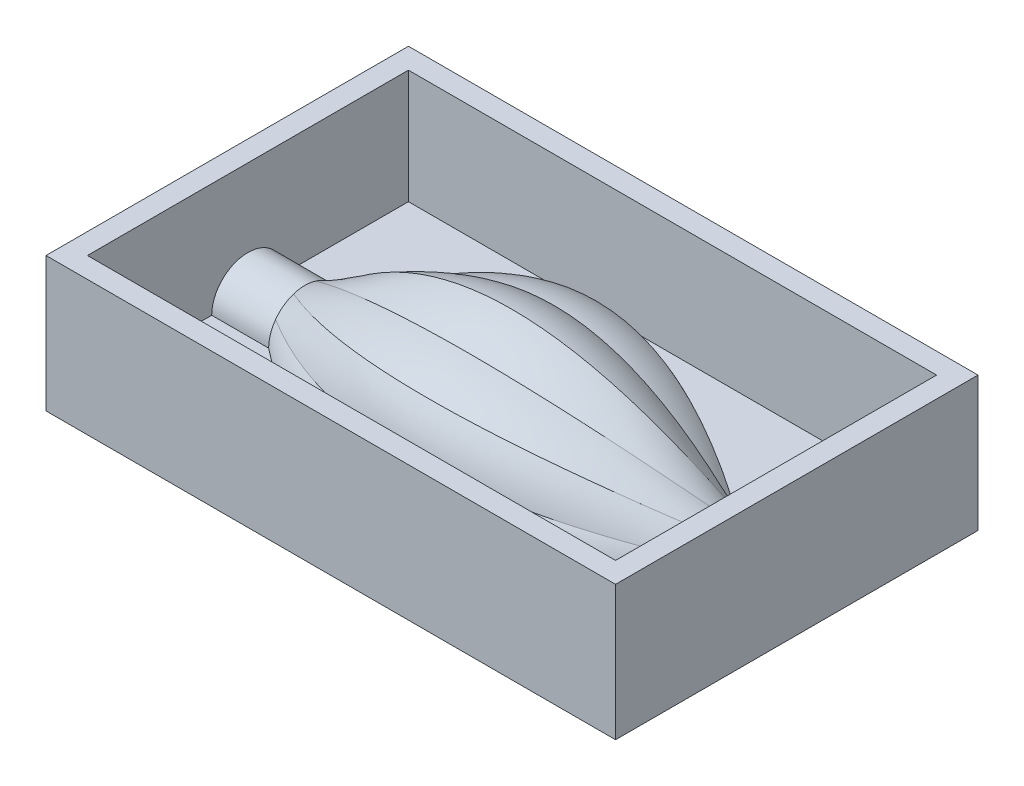
ISO-10303-21;
HEADER;
FILE_DESCRIPTION(('STEP AP214'),'2;1');
FILE_NAME('part.step','',(''),(''),'','','');
FILE_SCHEMA(('AUTOMOTIVE_DESIGN { 1 0 10303 214 1 1 1 1 }'));
ENDSEC;
DATA;
#1=APPLICATION_CONTEXT('core data for automotive mechanical design processes');
#2=APPLICATION_PROTOCOL_DEFINITION('international standard','automotive_design',2000,#1);
#3=PRODUCT_CONTEXT('',#1,'mechanical');
#4=PRODUCT('Part','Part','',(#3));
#5=PRODUCT_RELATED_PRODUCT_CATEGORY('part','',(#4));
#6=PRODUCT_DEFINITION_FORMATION('','',#4);
#7=PRODUCT_DEFINITION_CONTEXT('part definition',#1,'design');
#8=PRODUCT_DEFINITION('design','',#6,#7);
#9=PRODUCT_DEFINITION_SHAPE('','',#8);
#10=(LENGTH_UNIT() NAMED_UNIT(*) SI_UNIT(.MILLI.,.METRE.));
#11=(NAMED_UNIT(*) PLANE_ANGLE_UNIT() SI_UNIT($,.RADIAN.));
#12=(NAMED_UNIT(*) SI_UNIT($,.STERADIAN.) SOLID_ANGLE_UNIT());
#13=UNCERTAINTY_MEASURE_WITH_UNIT(LENGTH_MEASURE(1.E-05),#10,'distance_accuracy_value','');
#14=(GEOMETRIC_REPRESENTATION_CONTEXT(3) GLOBAL_UNCERTAINTY_ASSIGNED_CONTEXT((#13)) GLOBAL_UNIT_ASSIGNED_CONTEXT((#10,
#11,#12)) REPRESENTATION_CONTEXT('',''));
#15=CARTESIAN_POINT('',(0.,0.,0.));
#16=DIRECTION('',(0.,0.,1.));
#17=DIRECTION('',(1.,0.,0.));
#18=AXIS2_PLACEMENT_3D('',#15,#16,#17);
#19=CARTESIAN_POINT('',(-40.,0.,-7.));
#20=CARTESIAN_POINT('',(-26.6666666666667,13.0598267919562,-7.74289071280507));
#21=CARTESIAN_POINT('',(0.,26.1196535839123,-8.48578142561015));
#22=CARTESIAN_POINT('',(26.6666666666667,13.0598267919562,-7.74289071280507));
#23=CARTESIAN_POINT('',(40.,0.,-7.));
#24=CARTESIAN_POINT('',(-40.,1.47822579558818,-7.));
#25=CARTESIAN_POINT('',(-26.6666666666667,14.3815554866597,-6.23678959506464));
#26=CARTESIAN_POINT('',(0.,28.4089485090481,-5.24723210024778));
#27=CARTESIAN_POINT('',(26.6666666666667,14.3815554866597,-6.23678959506464));
#28=CARTESIAN_POINT('',(40.,1.47822579558818,-7.));
#29=CARTESIAN_POINT('',(-40.,2.91858697589288,-6.53199828282975));
#30=CARTESIAN_POINT('',(-26.6666666666667,15.6654195660797,-4.26268676015395));
#31=CARTESIAN_POINT('',(0.,29.472014573582,-1.63707421355165));
#32=CARTESIAN_POINT('',(26.6666666666667,15.6654195660797,-4.26268676015395));
#33=CARTESIAN_POINT('',(40.,2.91858697589288,-6.53199828282975));
#34=CARTESIAN_POINT('',(-40.,4.11449676604717,-5.66311896062474));
#35=CARTESIAN_POINT('',(-26.6666666666667,16.7048322553493,-1.88770632020851));
#36=CARTESIAN_POINT('',(0.,29.2951677446515,1.88770632020772));
#37=CARTESIAN_POINT('',(26.6666666666667,16.7048322553493,-1.88770632020851));
#38=CARTESIAN_POINT('',(40.,4.11449676604717,-5.66311896062474));
#39=B_SPLINE_SURFACE_WITH_KNOTS('',3,3,((#19,#20,#21,#22,#23),(#24,#25,#26,#27,#28),(#29,#30,
#31,#32,#33),(#34,#35,#36,#37,#38)),.UNSPECIFIED.,.F.,.F.,.F.,(4,4),(4,1,4),(0.,1.),(0.,0.5,1.),.UNSPECIFIED.);
#40=CARTESIAN_POINT('',(-40.,0.,0.));
#41=DIRECTION('',(1.,0.,0.));
#42=DIRECTION('',(0.,0.,-1.));
#43=AXIS2_PLACEMENT_3D('',#40,#41,#42);
#44=CIRCLE('',#43,7.);
#45=CARTESIAN_POINT('',(-40.,0.,-7.));
#46=VERTEX_POINT('',#45);
#47=CARTESIAN_POINT('',(-40.,4.11449676604717,-5.66311896062474));
#48=VERTEX_POINT('',#47);
#49=EDGE_CURVE('E334',#46,#48,#44,.T.);
#50=CARTESIAN_POINT('',(-40.,4.11449676604717,-5.66311896062474));
#51=CARTESIAN_POINT('',(-26.6666666666667,16.7048322553493,-1.88770632020851));
#52=CARTESIAN_POINT('',(0.,29.2951677446515,1.88770632020772));
#53=CARTESIAN_POINT('',(26.6666666666667,16.7048322553493,-1.88770632020851));
#54=CARTESIAN_POINT('',(40.,4.11449676604717,-5.66311896062474));
#55=B_SPLINE_CURVE_WITH_KNOTS('',3,(#50,#51,#52,#53,#54),.UNSPECIFIED.,.F.,.F.,(4,1,4),(0.,0.5,
1.),.UNSPECIFIED.);
#56=CARTESIAN_POINT('',(40.,4.11449676604717,-5.66311896062474));
#57=VERTEX_POINT('',#56);
#58=EDGE_CURVE('E379',#48,#57,#55,.T.);
#59=CARTESIAN_POINT('',(40.,0.,0.));
#60=DIRECTION('',(1.,0.,0.));
#61=DIRECTION('',(0.,0.,-1.));
#62=AXIS2_PLACEMENT_3D('',#59,#60,#61);
#63=CIRCLE('',#62,7.);
#64=CARTESIAN_POINT('',(40.,0.,-7.));
#65=VERTEX_POINT('',#64);
#66=EDGE_CURVE('E241',#65,#57,#63,.T.);
#67=CARTESIAN_POINT('',(-40.,0.,-7.));
#68=CARTESIAN_POINT('',(-26.6666666666667,13.0598267919562,-7.74289071280507));
#69=CARTESIAN_POINT('',(0.,26.1196535839123,-8.48578142561015));
#70=CARTESIAN_POINT('',(26.6666666666667,13.0598267919562,-7.74289071280507));
#71=CARTESIAN_POINT('',(40.,0.,-7.));
#72=B_SPLINE_CURVE_WITH_KNOTS('',3,(#67,#68,#69,#70,#71),.UNSPECIFIED.,.F.,.F.,(4,1,4),(0.,0.5,
1.),.UNSPECIFIED.);
#73=EDGE_CURVE('E374',#65,#46,#72,.F.);
#74=ORIENTED_EDGE('',*,*,#49,.T.);
#75=ORIENTED_EDGE('',*,*,#58,.T.);
#76=ORIENTED_EDGE('',*,*,#66,.F.);
#77=ORIENTED_EDGE('',*,*,#73,.T.);
#78=EDGE_LOOP('',(#74,#75,#76,#77));
#79=FACE_BOUND('',#78,.T.);
#80=ADVANCED_FACE('F127',(#79),#39,.T.);
#81=CARTESIAN_POINT('',(-40.,4.11449676604717,-5.66311896062474));
#82=CARTESIAN_POINT('',(-26.6666666666667,16.7048322553493,-1.8877063202085));
#83=CARTESIAN_POINT('',(0.,29.2951677446514,1.88770632020775));
#84=CARTESIAN_POINT('',(26.6666666666667,16.7048322553493,-1.8877063202085));
#85=CARTESIAN_POINT('',(40.,4.11449676604717,-5.66311896062474));
#86=CARTESIAN_POINT('',(-40.,5.31040655620154,-4.79423963841967));
#87=CARTESIAN_POINT('',(-26.6666666666667,16.577817898818,0.00658101737605748));
#88=CARTESIAN_POINT('',(0.,28.5596162408436,5.89317995632842));
#89=CARTESIAN_POINT('',(26.6666666666667,16.577817898818,0.00658101737605749));
#90=CARTESIAN_POINT('',(40.,5.31040655620154,-4.79423963841967));
#91=CARTESIAN_POINT('',(-40.,6.20059872170584,-3.56899523607451));
#92=CARTESIAN_POINT('',(-26.6666666666667,16.1450859176367,2.2572334351007));
#93=CARTESIAN_POINT('',(0.,26.6454180780708,9.22678826021097));
#94=CARTESIAN_POINT('',(26.6666666666667,16.1450859176367,2.2572334351007));
#95=CARTESIAN_POINT('',(40.,6.20059872170584,-3.56899523607451));
#96=CARTESIAN_POINT('',(-40.,6.65739561406606,-2.16311896062469));
#97=CARTESIAN_POINT('',(-26.6666666666667,15.2789586633113,4.68851772593));
#98=CARTESIAN_POINT('',(0.,23.9005217125565,11.5401544124847));
#99=CARTESIAN_POINT('',(26.6666666666667,15.2789586633113,4.68851772593));
#100=CARTESIAN_POINT('',(40.,6.65739561406606,-2.16311896062469));
#101=B_SPLINE_SURFACE_WITH_KNOTS('',3,3,((#81,#82,#83,#84,#85),(#86,#87,#88,#89,#90),(#91,#92,
#93,#94,#95),(#96,#97,#98,#99,#100)),.UNSPECIFIED.,.F.,.F.,.F.,(4,4),(4,1,4),(0.,1.),(0.,0.5,
1.),.UNSPECIFIED.);
#102=CARTESIAN_POINT('',(-40.,6.65739561406606,-2.16311896062469));
#103=VERTEX_POINT('',#102);
#104=EDGE_CURVE('E332',#48,#103,#44,.T.);
#105=CARTESIAN_POINT('',(-40.,6.65739561406606,-2.16311896062469));
#106=CARTESIAN_POINT('',(-26.6666666666667,15.2789586633113,4.68851772593));
#107=CARTESIAN_POINT('',(0.,23.9005217125565,11.5401544124847));
#108=CARTESIAN_POINT('',(26.6666666666667,15.2789586633113,4.68851772593));
#109=CARTESIAN_POINT('',(40.,6.65739561406606,-2.16311896062469));
#110=B_SPLINE_CURVE_WITH_KNOTS('',3,(#105,#106,#107,#108,#109),.UNSPECIFIED.,.F.,.F.,(4,1,4),
(0.,0.5,1.),.UNSPECIFIED.);
#111=CARTESIAN_POINT('',(40.,6.65739561406606,-2.16311896062469));
#112=VERTEX_POINT('',#111);
#113=EDGE_CURVE('E192',#103,#112,#110,.T.);
#114=EDGE_CURVE('E198',#57,#112,#63,.T.);
#115=ORIENTED_EDGE('',*,*,#104,.T.);
#116=ORIENTED_EDGE('',*,*,#113,.T.);
#117=ORIENTED_EDGE('',*,*,#114,.F.);
#118=ORIENTED_EDGE('',*,*,#58,.F.);
#119=EDGE_LOOP('',(#115,#116,#117,#118));
#120=FACE_BOUND('',#119,.T.);
#121=ADVANCED_FACE('F585',(#120),#101,.T.);
#122=CARTESIAN_POINT('',(-40.,0.,-5.29811695465203));
#123=CARTESIAN_POINT('',(-26.6666666666667,10.8423039781939,-12.6083429630781));
#124=CARTESIAN_POINT('',(0.,21.6846079563879,-19.9185689715042));
#125=CARTESIAN_POINT('',(26.6666666666667,10.8423039781939,-12.6083429630781));
#126=CARTESIAN_POINT('',(40.,0.,-5.29811695465203));
#127=CARTESIAN_POINT('',(-40.,0.,-5.86541130310135));
#128=CARTESIAN_POINT('',(-26.6666666666667,11.581478249448,-10.9865255463204));
#129=CARTESIAN_POINT('',(0.,24.5072685079548,-16.7586992273094));
#130=CARTESIAN_POINT('',(26.6666666666667,11.581478249448,-10.9865255463204));
#131=CARTESIAN_POINT('',(40.,0.,-5.86541130310135));
#132=CARTESIAN_POINT('',(-40.,0.,-6.43270565155068));
#133=CARTESIAN_POINT('',(-26.6666666666667,12.320652520702,-9.36470812956275));
#134=CARTESIAN_POINT('',(0.,26.0572326411018,-12.7723178001438));
#135=CARTESIAN_POINT('',(26.6666666666667,12.320652520702,-9.36470812956275));
#136=CARTESIAN_POINT('',(40.,0.,-6.43270565155068));
#137=CARTESIAN_POINT('',(-40.,0.,-7.));
#138=CARTESIAN_POINT('',(-26.6666666666667,13.0598267919561,-7.74289071280506));
#139=CARTESIAN_POINT('',(0.,26.1196535839122,-8.48578142561012));
#140=CARTESIAN_POINT('',(26.6666666666667,13.0598267919561,-7.74289071280506));
#141=CARTESIAN_POINT('',(40.,0.,-7.));
#142=B_SPLINE_SURFACE_WITH_KNOTS('',3,3,((#122,#123,#124,#125,#126),(#127,#128,#129,#130,#131),
(#132,#133,#134,#135,#136),(#137,#138,#139,#140,#141)),.UNSPECIFIED.,.F.,.F.,.F.,(4,4),(4,1,4),
(0.,1.),(0.,0.5,1.),.UNSPECIFIED.);
#143=DIRECTION('',(0.,0.,-1.));
#144=VECTOR('',#143,1.);
#145=CARTESIAN_POINT('',(-40.,0.,7.));
#146=LINE('',#145,#144);
#147=CARTESIAN_POINT('',(-40.,0.,-5.29811695465203));
#148=VERTEX_POINT('',#147);
#149=EDGE_CURVE('E337',#148,#46,#146,.T.);
#150=DIRECTION('',(0.,0.,-1.));
#151=VECTOR('',#150,1.);
#152=CARTESIAN_POINT('',(40.,0.,7.));
#153=LINE('',#152,#151);
#154=CARTESIAN_POINT('',(40.,0.,-5.29811695465203));
#155=VERTEX_POINT('',#154);
#156=EDGE_CURVE('E254',#155,#65,#153,.T.);
#157=CARTESIAN_POINT('',(-40.,0.,-5.29811695465203));
#158=CARTESIAN_POINT('',(-26.6666666666667,10.8423039781939,-12.6083429630782));
#159=CARTESIAN_POINT('',(0.,21.6846079563879,-19.9185689715043));
#160=CARTESIAN_POINT('',(26.6666666666667,10.8423039781939,-12.6083429630782));
#161=CARTESIAN_POINT('',(40.,0.,-5.29811695465203));
#162=B_SPLINE_CURVE_WITH_KNOTS('',3,(#157,#158,#159,#160,#161),.UNSPECIFIED.,.F.,.F.,(4,1,4),
(0.,0.5,1.),.UNSPECIFIED.);
#163=EDGE_CURVE('E347',#148,#155,#162,.T.);
#164=ORIENTED_EDGE('',*,*,#149,.T.);
#165=ORIENTED_EDGE('',*,*,#73,.F.);
#166=ORIENTED_EDGE('',*,*,#156,.F.);
#167=ORIENTED_EDGE('',*,*,#163,.F.);
#168=EDGE_LOOP('',(#164,#165,#166,#167));
#169=FACE_BOUND('',#168,.T.);
#170=ADVANCED_FACE('F376',(#169),#142,.T.);
#171=CARTESIAN_POINT('',(-40.,6.65739561406606,-2.16311896062469));
#172=CARTESIAN_POINT('',(-26.6666666666667,15.2789586633113,4.68851772592999));
#173=CARTESIAN_POINT('',(0.,23.9005217125565,11.5401544124847));
#174=CARTESIAN_POINT('',(26.6666666666667,15.2789586633113,4.68851772592999));
#175=CARTESIAN_POINT('',(40.,6.65739561406606,-2.16311896062469));
#176=CARTESIAN_POINT('',(-40.,7.11419250642625,-0.757242685174951));
#177=CARTESIAN_POINT('',(-26.6666666666667,14.9965812844174,6.94392332956505));
#178=CARTESIAN_POINT('',(0.,23.3813038773858,15.1931026001406));
#179=CARTESIAN_POINT('',(26.6666666666667,14.9965812844174,6.94392332956505));
#180=CARTESIAN_POINT('',(40.,7.11419250642625,-0.757242685174951));
#181=CARTESIAN_POINT('',(-40.,7.11419250642628,0.757242685174696));
#182=CARTESIAN_POINT('',(-26.6666666666667,14.2574070131634,9.30793802810001));
#183=CARTESIAN_POINT('',(0.,21.8313397442389,18.4372867455285));
#184=CARTESIAN_POINT('',(26.6666666666667,14.2574070131634,9.30793802810001));
#185=CARTESIAN_POINT('',(40.,7.11419250642628,0.757242685174696));
#186=CARTESIAN_POINT('',(-40.,6.65739561406613,2.16311896062445));
#187=CARTESIAN_POINT('',(-26.6666666666667,13.0614358495492,11.5633436317351));
#188=CARTESIAN_POINT('',(0.,19.4654760850323,20.9635683028457));
#189=CARTESIAN_POINT('',(26.6666666666667,13.0614358495492,11.5633436317351));
#190=CARTESIAN_POINT('',(40.,6.65739561406613,2.16311896062445));
#191=B_SPLINE_SURFACE_WITH_KNOTS('',3,3,((#171,#172,#173,#174,#175),(#176,#177,#178,#179,#180),
(#181,#182,#183,#184,#185),(#186,#187,#188,#189,#190)),.UNSPECIFIED.,.F.,.F.,.F.,(4,4),(4,1,4),
(0.,1.),(0.,0.5,1.),.UNSPECIFIED.);
#192=CARTESIAN_POINT('',(-40.,6.65739561406613,2.16311896062445));
#193=VERTEX_POINT('',#192);
#194=EDGE_CURVE('E149',#103,#193,#44,.T.);
#195=CARTESIAN_POINT('',(-40.,6.65739561406613,2.16311896062445));
#196=CARTESIAN_POINT('',(-26.6666666666667,13.0614358495492,11.5633436317351));
#197=CARTESIAN_POINT('',(0.,19.4654760850323,20.9635683028457));
#198=CARTESIAN_POINT('',(26.6666666666667,13.0614358495492,11.5633436317351));
#199=CARTESIAN_POINT('',(40.,6.65739561406613,2.16311896062445));
#200=B_SPLINE_CURVE_WITH_KNOTS('',3,(#195,#196,#197,#198,#199),.UNSPECIFIED.,.F.,.F.,(4,1,4),
(0.,0.5,1.),.UNSPECIFIED.);
#201=CARTESIAN_POINT('',(40.,6.65739561406613,2.16311896062445));
#202=VERTEX_POINT('',#201);
#203=EDGE_CURVE('E174',#193,#202,#200,.T.);
#204=EDGE_CURVE('E181',#112,#202,#63,.T.);
#205=ORIENTED_EDGE('',*,*,#194,.T.);
#206=ORIENTED_EDGE('',*,*,#203,.T.);
#207=ORIENTED_EDGE('',*,*,#204,.F.);
#208=ORIENTED_EDGE('',*,*,#113,.F.);
#209=EDGE_LOOP('',(#205,#206,#207,#208));
#210=FACE_BOUND('',#209,.T.);
#211=ADVANCED_FACE('F187',(#210),#191,.T.);
#212=CARTESIAN_POINT('',(-40.,6.65739561406613,2.16311896062445));
#213=CARTESIAN_POINT('',(-26.6666666666667,13.0614358495492,11.5633436317351));
#214=CARTESIAN_POINT('',(0.,19.4654760850324,20.9635683028457));
#215=CARTESIAN_POINT('',(26.6666666666667,13.0614358495492,11.5633436317351));
#216=CARTESIAN_POINT('',(40.,6.65739561406613,2.16311896062445));
#217=CARTESIAN_POINT('',(-40.,6.20059872170594,3.56899523607437));
#218=CARTESIAN_POINT('',(-26.6666666666667,11.3588120571746,12.9306164006612));
#219=CARTESIAN_POINT('',(0.,16.3864127164543,23.1581303567408));
#220=CARTESIAN_POINT('',(26.6666666666667,11.3588120571746,12.9306164006612));
#221=CARTESIAN_POINT('',(40.,6.20059872170594,3.56899523607437));
#222=CARTESIAN_POINT('',(-40.,5.31040655620161,4.79423963841961));
#223=CARTESIAN_POINT('',(-26.6666666666667,9.22279299165583,14.1172572964827));
#224=CARTESIAN_POINT('',(0.,12.9142329380495,24.2606278653204));
#225=CARTESIAN_POINT('',(26.6666666666667,9.22279299165583,14.1172572964827));
#226=CARTESIAN_POINT('',(40.,5.31040655620161,4.79423963841961));
#227=CARTESIAN_POINT('',(-40.,4.11449676604717,5.66311896062473));
#228=CARTESIAN_POINT('',(-26.6666666666667,6.78105630148695,14.9475331121641));
#229=CARTESIAN_POINT('',(0.,9.44761583692672,24.2319472637035));
#230=CARTESIAN_POINT('',(26.6666666666667,6.78105630148695,14.9475331121641));
#231=CARTESIAN_POINT('',(40.,4.11449676604717,5.66311896062473));
#232=B_SPLINE_SURFACE_WITH_KNOTS('',3,3,((#212,#213,#214,#215,#216),(#217,#218,#219,#220,#221),
(#222,#223,#224,#225,#226),(#227,#228,#229,#230,#231)),.UNSPECIFIED.,.F.,.F.,.F.,(4,4),(4,1,4),
(0.,1.),(0.,0.5,1.),.UNSPECIFIED.);
#233=CARTESIAN_POINT('',(-40.,4.11449676604717,5.66311896062473));
#234=VERTEX_POINT('',#233);
#235=EDGE_CURVE('E313',#193,#234,#44,.T.);
#236=CARTESIAN_POINT('',(-40.,4.11449676604717,5.66311896062473));
#237=CARTESIAN_POINT('',(-26.6666666666667,6.78105630148695,14.9475331121641));
#238=CARTESIAN_POINT('',(0.,9.44761583692672,24.2319472637035));
#239=CARTESIAN_POINT('',(26.6666666666667,6.78105630148695,14.9475331121641));
#240=CARTESIAN_POINT('',(40.,4.11449676604717,5.66311896062473));
#241=B_SPLINE_CURVE_WITH_KNOTS('',3,(#236,#237,#238,#239,#240),.UNSPECIFIED.,.F.,.F.,(4,1,4),
(0.,0.5,1.),.UNSPECIFIED.);
#242=CARTESIAN_POINT('',(40.,4.11449676604717,5.66311896062473));
#243=VERTEX_POINT('',#242);
#244=EDGE_CURVE('E176',#234,#243,#241,.T.);
#245=EDGE_CURVE('E168',#202,#243,#63,.T.);
#246=ORIENTED_EDGE('',*,*,#235,.T.);
#247=ORIENTED_EDGE('',*,*,#244,.T.);
#248=ORIENTED_EDGE('',*,*,#245,.F.);
#249=ORIENTED_EDGE('',*,*,#203,.F.);
#250=EDGE_LOOP('',(#246,#247,#248,#249));
#251=FACE_BOUND('',#250,.T.);
#252=ADVANCED_FACE('F172',(#251),#232,.T.);
#253=CARTESIAN_POINT('',(-40.,4.11449676604717,5.66311896062473));
#254=CARTESIAN_POINT('',(-26.6666666666667,6.78105630148695,14.9475331121641));
#255=CARTESIAN_POINT('',(0.,9.44761583692673,24.2319472637035));
#256=CARTESIAN_POINT('',(26.6666666666667,6.78105630148695,14.9475331121641));
#257=CARTESIAN_POINT('',(40.,4.11449676604717,5.66311896062473));
#258=CARTESIAN_POINT('',(-40.,2.91858697589289,6.53199828282975));
#259=CARTESIAN_POINT('',(-26.6666666666667,4.69629333285265,16.2771632727449));
#260=CARTESIAN_POINT('',(0.,6.78772836245819,26.513340722962));
#261=CARTESIAN_POINT('',(26.6666666666667,4.69629333285265,16.2771632727449));
#262=CARTESIAN_POINT('',(40.,2.91858697589289,6.53199828282975));
#263=CARTESIAN_POINT('',(-40.,1.47822579558818,7.));
#264=CARTESIAN_POINT('',(-26.6666666666667,2.36707897406793,17.2059158282908));
#265=CARTESIAN_POINT('',(0.,3.53268199963608,27.9315183113699));
#266=CARTESIAN_POINT('',(26.6666666666667,2.36707897406793,17.2059158282908));
#267=CARTESIAN_POINT('',(40.,1.47822579558818,7.));
#268=CARTESIAN_POINT('',(-40.,0.,7.));
#269=CARTESIAN_POINT('',(-26.6666666666667,-2.68044845578667E-13,17.6666666666666));
#270=CARTESIAN_POINT('',(0.,-5.36866847274572E-13,28.3333333333331));
#271=CARTESIAN_POINT('',(26.6666666666667,-2.68044845578667E-13,17.6666666666666));
#272=CARTESIAN_POINT('',(40.,0.,7.));
#273=B_SPLINE_SURFACE_WITH_KNOTS('',3,3,((#253,#254,#255,#256,#257),(#258,#259,#260,#261,#262),
(#263,#264,#265,#266,#267),(#268,#269,#270,#271,#272)),.UNSPECIFIED.,.F.,.F.,.F.,(4,4),(4,1,4),
(0.,1.),(0.,0.5,1.),.UNSPECIFIED.);
#274=CARTESIAN_POINT('',(-40.,0.,7.));
#275=VERTEX_POINT('',#274);
#276=EDGE_CURVE('E134',#234,#275,#44,.T.);
#277=CARTESIAN_POINT('',(-40.,0.,7.));
#278=CARTESIAN_POINT('',(-26.6666666666667,-2.68044845578667E-13,17.6666666666666));
#279=CARTESIAN_POINT('',(0.,-5.36866847274572E-13,28.3333333333331));
#280=CARTESIAN_POINT('',(26.6666666666667,-2.68044845578667E-13,17.6666666666666));
#281=CARTESIAN_POINT('',(40.,0.,7.));
#282=B_SPLINE_CURVE_WITH_KNOTS('',3,(#277,#278,#279,#280,#281),.UNSPECIFIED.,.F.,.F.,(4,1,4),
(0.,0.5,1.),.UNSPECIFIED.);
#283=CARTESIAN_POINT('',(40.,0.,7.));
#284=VERTEX_POINT('',#283);
#285=EDGE_CURVE('E324',#275,#284,#282,.T.);
#286=EDGE_CURVE('E182',#243,#284,#63,.T.);
#287=ORIENTED_EDGE('',*,*,#276,.T.);
#288=ORIENTED_EDGE('',*,*,#285,.T.);
#289=ORIENTED_EDGE('',*,*,#286,.F.);
#290=ORIENTED_EDGE('',*,*,#244,.F.);
#291=EDGE_LOOP('',(#287,#288,#289,#290));
#292=FACE_BOUND('',#291,.T.);
#293=ADVANCED_FACE('F622',(#292),#273,.T.);
#294=CARTESIAN_POINT('',(-40.,0.,-1.89435086395607));
#295=CARTESIAN_POINT('',(-26.6666666666667,-2.72640706307688E-13,-15.9647836213195));
#296=CARTESIAN_POINT('',(0.,-5.45281412615377E-13,-30.0352163786829));
#297=CARTESIAN_POINT('',(26.6666666666667,-2.72640706307688E-13,-15.9647836213195));
#298=CARTESIAN_POINT('',(40.,0.,-1.89435086395607));
#299=CARTESIAN_POINT('',(-40.,0.,-2.46164521240546));
#300=CARTESIAN_POINT('',(-26.6666666666667,1.80318579315723,-15.3960462236766));
#301=CARTESIAN_POINT('',(0.,4.09657518054796,-29.7413879159868));
#302=CARTESIAN_POINT('',(26.6666666666667,1.80318579315723,-15.3960462236766));
#303=CARTESIAN_POINT('',(40.,0.,-2.46164521240546));
#304=CARTESIAN_POINT('',(-40.,0.,-3.02893956085484));
#305=CARTESIAN_POINT('',(-26.6666666666667,3.60637158631473,-14.8273088260338));
#306=CARTESIAN_POINT('',(0.,7.87765010899839,-27.9631951696752));
#307=CARTESIAN_POINT('',(26.6666666666667,3.60637158631473,-14.8273088260338));
#308=CARTESIAN_POINT('',(40.,0.,-3.02893956085484));
#309=CARTESIAN_POINT('',(-40.,0.,-3.59623390930423));
#310=CARTESIAN_POINT('',(-26.6666666666667,5.40955737947223,-14.258571428391));
#311=CARTESIAN_POINT('',(0.,10.8191147589445,-24.9209089474778));
#312=CARTESIAN_POINT('',(26.6666666666667,5.40955737947223,-14.258571428391));
#313=CARTESIAN_POINT('',(40.,0.,-3.59623390930423));
#314=B_SPLINE_SURFACE_WITH_KNOTS('',3,3,((#294,#295,#296,#297,#298),(#299,#300,#301,#302,#303),
(#304,#305,#306,#307,#308),(#309,#310,#311,#312,#313)),.UNSPECIFIED.,.F.,.F.,.F.,(4,4),(4,1,4),
(0.,1.),(0.,0.5,1.),.UNSPECIFIED.);
#315=CARTESIAN_POINT('',(-40.,0.,-1.89435086395624));
#316=VERTEX_POINT('',#315);
#317=CARTESIAN_POINT('',(-40.,0.,-3.59623390930423));
#318=VERTEX_POINT('',#317);
#319=EDGE_CURVE('E141',#316,#318,#146,.T.);
#320=CARTESIAN_POINT('',(-40.,0.,-3.59623390930423));
#321=CARTESIAN_POINT('',(-26.6666666666667,5.40955737947223,-14.258571428391));
#322=CARTESIAN_POINT('',(0.,10.8191147589445,-24.9209089474778));
#323=CARTESIAN_POINT('',(26.6666666666667,5.40955737947223,-14.258571428391));
#324=CARTESIAN_POINT('',(40.,0.,-3.59623390930423));
#325=B_SPLINE_CURVE_WITH_KNOTS('',3,(#320,#321,#322,#323,#324),.UNSPECIFIED.,.F.,.F.,(4,1,4),
(0.,0.5,1.),.UNSPECIFIED.);
#326=CARTESIAN_POINT('',(40.,0.,-3.59623390930423));
#327=VERTEX_POINT('',#326);
#328=EDGE_CURVE('E531',#318,#327,#325,.T.);
#329=CARTESIAN_POINT('',(40.,0.,-1.89435086395607));
#330=VERTEX_POINT('',#329);
#331=EDGE_CURVE('E345',#330,#327,#153,.T.);
#332=CARTESIAN_POINT('',(-40.,0.,-1.89435086395607));
#333=CARTESIAN_POINT('',(-26.6666666666667,-2.73797188625006E-13,-15.9647836213195));
#334=CARTESIAN_POINT('',(0.,-5.47594377250012E-13,-30.0352163786829));
#335=CARTESIAN_POINT('',(26.6666666666667,-2.73797188625006E-13,-15.9647836213195));
#336=CARTESIAN_POINT('',(40.,0.,-1.89435086395607));
#337=B_SPLINE_CURVE_WITH_KNOTS('',3,(#332,#333,#334,#335,#336),.UNSPECIFIED.,.F.,.F.,(4,1,4),
(0.,0.5,1.),.UNSPECIFIED.);
#338=EDGE_CURVE('E522',#316,#330,#337,.T.);
#339=ORIENTED_EDGE('',*,*,#319,.T.);
#340=ORIENTED_EDGE('',*,*,#328,.T.);
#341=ORIENTED_EDGE('',*,*,#331,.F.);
#342=ORIENTED_EDGE('',*,*,#338,.F.);
#343=EDGE_LOOP('',(#339,#340,#341,#342));
#344=FACE_BOUND('',#343,.T.);
#345=ADVANCED_FACE('F529',(#344),#314,.T.);
#346=CARTESIAN_POINT('',(-40.,0.,-3.59623390930423));
#347=CARTESIAN_POINT('',(-26.6666666666667,5.40955737947217,-14.2585714283909));
#348=CARTESIAN_POINT('',(0.,10.8191147589443,-24.9209089474776));
#349=CARTESIAN_POINT('',(26.6666666666667,5.40955737947217,-14.2585714283909));
#350=CARTESIAN_POINT('',(40.,0.,-3.59623390930423));
#351=CARTESIAN_POINT('',(-40.,0.,-4.16352825775349));
#352=CARTESIAN_POINT('',(-26.6666666666667,7.22047291237943,-13.7084952732867));
#353=CARTESIAN_POINT('',(0.,14.9165530173278,-24.6693898885172));
#354=CARTESIAN_POINT('',(26.6666666666667,7.22047291237943,-13.7084952732867));
#355=CARTESIAN_POINT('',(40.,0.,-4.16352825775349));
#356=CARTESIAN_POINT('',(-40.,0.,-4.73082260620276));
#357=CARTESIAN_POINT('',(-26.6666666666667,9.03138844528668,-13.1584191181824));
#358=CARTESIAN_POINT('',(0.,18.7138363283431,-22.9303276392206));
#359=CARTESIAN_POINT('',(26.6666666666667,9.03138844528669,-13.1584191181824));
#360=CARTESIAN_POINT('',(40.,0.,-4.73082260620276));
#361=CARTESIAN_POINT('',(-40.,0.,-5.29811695465203));
#362=CARTESIAN_POINT('',(-26.6666666666667,10.8423039781939,-12.6083429630782));
#363=CARTESIAN_POINT('',(0.,21.6846079563879,-19.9185689715043));
#364=CARTESIAN_POINT('',(26.6666666666667,10.8423039781939,-12.6083429630782));
#365=CARTESIAN_POINT('',(40.,0.,-5.29811695465203));
#366=B_SPLINE_SURFACE_WITH_KNOTS('',3,3,((#346,#347,#348,#349,#350),(#351,#352,#353,#354,#355),
(#356,#357,#358,#359,#360),(#361,#362,#363,#364,#365)),.UNSPECIFIED.,.F.,.F.,.F.,(4,4),(4,1,4),
(0.,1.),(0.,0.5,1.),.UNSPECIFIED.);
#367=EDGE_CURVE('E340',#318,#148,#146,.T.);
#368=EDGE_CURVE('E348',#327,#155,#153,.T.);
#369=ORIENTED_EDGE('',*,*,#367,.T.);
#370=ORIENTED_EDGE('',*,*,#163,.T.);
#371=ORIENTED_EDGE('',*,*,#368,.F.);
#372=ORIENTED_EDGE('',*,*,#328,.F.);
#373=EDGE_LOOP('',(#369,#370,#371,#372));
#374=FACE_BOUND('',#373,.T.);
#375=ADVANCED_FACE('F129',(#374),#366,.T.);
#376=CARTESIAN_POINT('',(-55.,0.,0.));
#377=DIRECTION('',(1.,0.,0.));
#378=DIRECTION('',(0.,0.,-1.));
#379=AXIS2_PLACEMENT_3D('',#376,#377,#378);
#380=CYLINDRICAL_SURFACE('',#379,7.);
#381=CARTESIAN_POINT('',(-51.,0.,0.));
#382=DIRECTION('',(1.,0.,0.));
#383=DIRECTION('',(0.,0.,-1.));
#384=AXIS2_PLACEMENT_3D('',#381,#382,#383);
#385=CIRCLE('',#384,7.);
#386=CARTESIAN_POINT('',(-51.,0.,7.));
#387=VERTEX_POINT('',#386);
#388=CARTESIAN_POINT('',(-51.,0.,-7.));
#389=VERTEX_POINT('',#388);
#390=EDGE_CURVE('E12',#387,#389,#385,.F.);
#391=ORIENTED_EDGE('',*,*,#390,.F.);
#392=DIRECTION('',(1.,0.,0.));
#393=VECTOR('',#392,1.);
#394=CARTESIAN_POINT('',(-55.,0.,7.));
#395=LINE('',#394,#393);
#396=EDGE_CURVE('E260',#387,#275,#395,.T.);
#397=ORIENTED_EDGE('',*,*,#396,.T.);
#398=ORIENTED_EDGE('',*,*,#276,.F.);
#399=ORIENTED_EDGE('',*,*,#235,.F.);
#400=ORIENTED_EDGE('',*,*,#194,.F.);
#401=ORIENTED_EDGE('',*,*,#104,.F.);
#402=ORIENTED_EDGE('',*,*,#49,.F.);
#403=DIRECTION('',(1.,0.,0.));
#404=VECTOR('',#403,1.);
#405=CARTESIAN_POINT('',(-55.,0.,-7.));
#406=LINE('',#405,#404);
#407=EDGE_CURVE('E256',#389,#46,#406,.T.);
#408=ORIENTED_EDGE('',*,*,#407,.F.);
#409=EDGE_LOOP('',(#391,#397,#398,#399,#400,#401,#402,#408));
#410=FACE_BOUND('',#409,.T.);
#411=ADVANCED_FACE('F289',(#410),#380,.T.);
#412=CARTESIAN_POINT('',(-55.,0.,0.));
#413=DIRECTION('',(1.,0.,0.));
#414=DIRECTION('',(0.,0.,-1.));
#415=AXIS2_PLACEMENT_3D('',#412,#413,#414);
#416=PLANE('',#415);
#417=DIRECTION('',(0.,-1.,0.));
#418=VECTOR('',#417,1.);
#419=CARTESIAN_POINT('',(-55.,22.,-35.));
#420=LINE('',#419,#418);
#421=CARTESIAN_POINT('',(-55.,22.,-35.));
#422=VERTEX_POINT('',#421);
#423=CARTESIAN_POINT('',(-55.,-4.,-35.));
#424=VERTEX_POINT('',#423);
#425=EDGE_CURVE('E401',#422,#424,#420,.T.);
#426=ORIENTED_EDGE('',*,*,#425,.T.);
#427=DIRECTION('',(0.,0.,1.));
#428=VECTOR('',#427,1.);
#429=CARTESIAN_POINT('',(-55.,-4.,-35.));
#430=LINE('',#429,#428);
#431=CARTESIAN_POINT('',(-55.,-4.,35.));
#432=VERTEX_POINT('',#431);
#433=EDGE_CURVE('E805',#424,#432,#430,.T.);
#434=ORIENTED_EDGE('',*,*,#433,.T.);
#435=DIRECTION('',(0.,-1.,0.));
#436=VECTOR('',#435,1.);
#437=CARTESIAN_POINT('',(-55.,22.,35.));
#438=LINE('',#437,#436);
#439=CARTESIAN_POINT('',(-55.,22.,35.));
#440=VERTEX_POINT('',#439);
#441=EDGE_CURVE('E411',#440,#432,#438,.T.);
#442=ORIENTED_EDGE('',*,*,#441,.F.);
#443=DIRECTION('',(0.,0.,1.));
#444=VECTOR('',#443,1.);
#445=CARTESIAN_POINT('',(-55.,22.,-35.));
#446=LINE('',#445,#444);
#447=EDGE_CURVE('E408',#422,#440,#446,.T.);
#448=ORIENTED_EDGE('',*,*,#447,.F.);
#449=EDGE_LOOP('',(#426,#434,#442,#448));
#450=FACE_BOUND('',#449,.T.);
#451=ADVANCED_FACE('F217',(#450),#416,.F.);
#452=CARTESIAN_POINT('',(46.,0.,0.));
#453=DIRECTION('',(-1.,0.,0.));
#454=DIRECTION('',(0.,0.,1.));
#455=AXIS2_PLACEMENT_3D('',#452,#453,#454);
#456=CYLINDRICAL_SURFACE('',#455,7.);
#457=ORIENTED_EDGE('',*,*,#66,.T.);
#458=ORIENTED_EDGE('',*,*,#114,.T.);
#459=ORIENTED_EDGE('',*,*,#204,.T.);
#460=ORIENTED_EDGE('',*,*,#245,.T.);
#461=ORIENTED_EDGE('',*,*,#286,.T.);
#462=DIRECTION('',(-1.,0.,0.));
#463=VECTOR('',#462,1.);
#464=CARTESIAN_POINT('',(46.,0.,7.));
#465=LINE('',#464,#463);
#466=CARTESIAN_POINT('',(46.,0.,7.));
#467=VERTEX_POINT('',#466);
#468=EDGE_CURVE('E389',#467,#284,#465,.T.);
#469=ORIENTED_EDGE('',*,*,#468,.F.);
#470=CARTESIAN_POINT('',(46.,0.,0.));
#471=DIRECTION('',(1.,0.,0.));
#472=DIRECTION('',(0.,0.,-1.));
#473=AXIS2_PLACEMENT_3D('',#470,#471,#472);
#474=CIRCLE('',#473,7.);
#475=CARTESIAN_POINT('',(46.,0.,-7.));
#476=VERTEX_POINT('',#475);
#477=EDGE_CURVE('E387',#476,#467,#474,.T.);
#478=ORIENTED_EDGE('',*,*,#477,.F.);
#479=DIRECTION('',(-1.,0.,0.));
#480=VECTOR('',#479,1.);
#481=CARTESIAN_POINT('',(46.,0.,-7.));
#482=LINE('',#481,#480);
#483=EDGE_CURVE('E269',#476,#65,#482,.T.);
#484=ORIENTED_EDGE('',*,*,#483,.T.);
#485=EDGE_LOOP('',(#457,#458,#459,#460,#461,#469,#478,#484));
#486=FACE_BOUND('',#485,.T.);
#487=ADVANCED_FACE('F197',(#486),#456,.T.);
#488=CARTESIAN_POINT('',(46.,0.,0.));
#489=DIRECTION('',(1.,0.,0.));
#490=DIRECTION('',(0.,0.,-1.));
#491=AXIS2_PLACEMENT_3D('',#488,#489,#490);
#492=PLANE('',#491);
#493=DIRECTION('',(0.,0.,-1.));
#494=VECTOR('',#493,1.);
#495=CARTESIAN_POINT('',(46.,0.,0.));
#496=LINE('',#495,#494);
#497=EDGE_CURVE('E398',#467,#476,#496,.T.);
#498=ORIENTED_EDGE('',*,*,#497,.T.);
#499=ORIENTED_EDGE('',*,*,#477,.T.);
#500=EDGE_LOOP('',(#498,#499));
#501=FACE_BOUND('',#500,.T.);
#502=ADVANCED_FACE('F216',(#501),#492,.T.);
#503=CARTESIAN_POINT('',(-55.,22.,-35.));
#504=DIRECTION('',(0.,0.,-1.));
#505=DIRECTION('',(-1.,0.,0.));
#506=AXIS2_PLACEMENT_3D('',#503,#504,#505);
#507=PLANE('',#506);
#508=DIRECTION('',(0.,-1.,0.));
#509=VECTOR('',#508,1.);
#510=CARTESIAN_POINT('',(55.,22.,-35.));
#511=LINE('',#510,#509);
#512=CARTESIAN_POINT('',(55.,22.,-35.));
#513=VERTEX_POINT('',#512);
#514=CARTESIAN_POINT('',(55.,-4.,-35.));
#515=VERTEX_POINT('',#514);
#516=EDGE_CURVE('E404',#513,#515,#511,.T.);
#517=ORIENTED_EDGE('',*,*,#516,.T.);
#518=DIRECTION('',(1.,0.,0.));
#519=VECTOR('',#518,1.);
#520=CARTESIAN_POINT('',(-55.,-4.,-35.));
#521=LINE('',#520,#519);
#522=EDGE_CURVE('E453',#424,#515,#521,.T.);
#523=ORIENTED_EDGE('',*,*,#522,.F.);
#524=ORIENTED_EDGE('',*,*,#425,.F.);
#525=DIRECTION('',(1.,0.,0.));
#526=VECTOR('',#525,1.);
#527=CARTESIAN_POINT('',(-55.,22.,-35.));
#528=LINE('',#527,#526);
#529=EDGE_CURVE('E424',#422,#513,#528,.T.);
#530=ORIENTED_EDGE('',*,*,#529,.T.);
#531=EDGE_LOOP('',(#517,#523,#524,#530));
#532=FACE_BOUND('',#531,.T.);
#533=ADVANCED_FACE('F832',(#532),#507,.T.);
#534=CARTESIAN_POINT('',(-55.,22.,35.));
#535=DIRECTION('',(0.,0.,-1.));
#536=DIRECTION('',(-1.,0.,0.));
#537=AXIS2_PLACEMENT_3D('',#534,#535,#536);
#538=PLANE('',#537);
#539=ORIENTED_EDGE('',*,*,#441,.T.);
#540=DIRECTION('',(1.,0.,0.));
#541=VECTOR('',#540,1.);
#542=CARTESIAN_POINT('',(-55.,-4.,35.));
#543=LINE('',#542,#541);
#544=CARTESIAN_POINT('',(55.,-4.,35.));
#545=VERTEX_POINT('',#544);
#546=EDGE_CURVE('E802',#432,#545,#543,.T.);
#547=ORIENTED_EDGE('',*,*,#546,.T.);
#548=DIRECTION('',(0.,-1.,0.));
#549=VECTOR('',#548,1.);
#550=CARTESIAN_POINT('',(55.,22.,35.));
#551=LINE('',#550,#549);
#552=CARTESIAN_POINT('',(55.,22.,35.));
#553=VERTEX_POINT('',#552);
#554=EDGE_CURVE('E407',#553,#545,#551,.T.);
#555=ORIENTED_EDGE('',*,*,#554,.F.);
#556=DIRECTION('',(1.,0.,0.));
#557=VECTOR('',#556,1.);
#558=CARTESIAN_POINT('',(-55.,22.,35.));
#559=LINE('',#558,#557);
#560=EDGE_CURVE('E418',#440,#553,#559,.T.);
#561=ORIENTED_EDGE('',*,*,#560,.F.);
#562=EDGE_LOOP('',(#539,#547,#555,#561));
#563=FACE_BOUND('',#562,.T.);
#564=ADVANCED_FACE('F827',(#563),#538,.F.);
#565=CARTESIAN_POINT('',(55.,22.,-35.));
#566=DIRECTION('',(1.,0.,0.));
#567=DIRECTION('',(0.,0.,-1.));
#568=AXIS2_PLACEMENT_3D('',#565,#566,#567);
#569=PLANE('',#568);
#570=ORIENTED_EDGE('',*,*,#554,.T.);
#571=DIRECTION('',(0.,0.,1.));
#572=VECTOR('',#571,1.);
#573=CARTESIAN_POINT('',(55.,-4.,-35.));
#574=LINE('',#573,#572);
#575=EDGE_CURVE('E799',#515,#545,#574,.T.);
#576=ORIENTED_EDGE('',*,*,#575,.F.);
#577=ORIENTED_EDGE('',*,*,#516,.F.);
#578=DIRECTION('',(0.,0.,1.));
#579=VECTOR('',#578,1.);
#580=CARTESIAN_POINT('',(55.,22.,-35.));
#581=LINE('',#580,#579);
#582=EDGE_CURVE('E421',#513,#553,#581,.T.);
#583=ORIENTED_EDGE('',*,*,#582,.T.);
#584=EDGE_LOOP('',(#570,#576,#577,#583));
#585=FACE_BOUND('',#584,.T.);
#586=ADVANCED_FACE('F824',(#585),#569,.T.);
#587=CARTESIAN_POINT('',(0.,22.,0.));
#588=DIRECTION('',(0.,-1.,0.));
#589=DIRECTION('',(0.,0.,-1.));
#590=AXIS2_PLACEMENT_3D('',#587,#588,#589);
#591=PLANE('',#590);
#592=DIRECTION('',(0.,0.,1.));
#593=VECTOR('',#592,1.);
#594=CARTESIAN_POINT('',(-51.,22.,-31.));
#595=LINE('',#594,#593);
#596=CARTESIAN_POINT('',(-51.,22.,-31.));
#597=VERTEX_POINT('',#596);
#598=CARTESIAN_POINT('',(-51.,22.,31.));
#599=VERTEX_POINT('',#598);
#600=EDGE_CURVE('E432',#597,#599,#595,.T.);
#601=ORIENTED_EDGE('',*,*,#600,.F.);
#602=DIRECTION('',(1.,0.,0.));
#603=VECTOR('',#602,1.);
#604=CARTESIAN_POINT('',(-51.,22.,-31.));
#605=LINE('',#604,#603);
#606=CARTESIAN_POINT('',(51.,22.,-31.));
#607=VERTEX_POINT('',#606);
#608=EDGE_CURVE('E442',#597,#607,#605,.T.);
#609=ORIENTED_EDGE('',*,*,#608,.T.);
#610=DIRECTION('',(0.,0.,1.));
#611=VECTOR('',#610,1.);
#612=CARTESIAN_POINT('',(51.,22.,-31.));
#613=LINE('',#612,#611);
#614=CARTESIAN_POINT('',(51.,22.,31.));
#615=VERTEX_POINT('',#614);
#616=EDGE_CURVE('E459',#607,#615,#613,.T.);
#617=ORIENTED_EDGE('',*,*,#616,.T.);
#618=DIRECTION('',(1.,0.,0.));
#619=VECTOR('',#618,1.);
#620=CARTESIAN_POINT('',(-51.,22.,31.));
#621=LINE('',#620,#619);
#622=EDGE_CURVE('E456',#599,#615,#621,.T.);
#623=ORIENTED_EDGE('',*,*,#622,.F.);
#624=EDGE_LOOP('',(#601,#609,#617,#623));
#625=FACE_BOUND('',#624,.T.);
#626=ORIENTED_EDGE('',*,*,#529,.F.);
#627=ORIENTED_EDGE('',*,*,#447,.T.);
#628=ORIENTED_EDGE('',*,*,#560,.T.);
#629=ORIENTED_EDGE('',*,*,#582,.F.);
#630=EDGE_LOOP('',(#626,#627,#628,#629));
#631=FACE_BOUND('',#630,.T.);
#632=ADVANCED_FACE('F830',(#625,#631),#591,.F.);
#633=CARTESIAN_POINT('',(-51.,22.,-31.));
#634=DIRECTION('',(0.,0.,-1.));
#635=DIRECTION('',(-1.,0.,0.));
#636=AXIS2_PLACEMENT_3D('',#633,#634,#635);
#637=PLANE('',#636);
#638=DIRECTION('',(1.,0.,0.));
#639=VECTOR('',#638,1.);
#640=CARTESIAN_POINT('',(-51.,0.,-31.));
#641=LINE('',#640,#639);
#642=CARTESIAN_POINT('',(-51.,0.,-31.));
#643=VERTEX_POINT('',#642);
#644=CARTESIAN_POINT('',(51.,0.,-31.));
#645=VERTEX_POINT('',#644);
#646=EDGE_CURVE('E450',#643,#645,#641,.T.);
#647=ORIENTED_EDGE('',*,*,#646,.T.);
#648=DIRECTION('',(0.,-1.,0.));
#649=VECTOR('',#648,1.);
#650=CARTESIAN_POINT('',(51.,22.,-31.));
#651=LINE('',#650,#649);
#652=EDGE_CURVE('E428',#607,#645,#651,.T.);
#653=ORIENTED_EDGE('',*,*,#652,.F.);
#654=ORIENTED_EDGE('',*,*,#608,.F.);
#655=DIRECTION('',(0.,-1.,0.));
#656=VECTOR('',#655,1.);
#657=CARTESIAN_POINT('',(-51.,22.,-31.));
#658=LINE('',#657,#656);
#659=EDGE_CURVE('E427',#597,#643,#658,.T.);
#660=ORIENTED_EDGE('',*,*,#659,.T.);
#661=EDGE_LOOP('',(#647,#653,#654,#660));
#662=FACE_BOUND('',#661,.T.);
#663=ADVANCED_FACE('F919',(#662),#637,.F.);
#664=CARTESIAN_POINT('',(-51.,22.,-31.));
#665=DIRECTION('',(1.,0.,0.));
#666=DIRECTION('',(0.,0.,-1.));
#667=AXIS2_PLACEMENT_3D('',#664,#665,#666);
#668=PLANE('',#667);
#669=DIRECTION('',(0.,0.,1.));
#670=VECTOR('',#669,1.);
#671=CARTESIAN_POINT('',(-51.,0.,-31.));
#672=LINE('',#671,#670);
#673=CARTESIAN_POINT('',(-51.,0.,31.));
#674=VERTEX_POINT('',#673);
#675=EDGE_CURVE('E443',#387,#674,#672,.T.);
#676=ORIENTED_EDGE('',*,*,#675,.F.);
#677=ORIENTED_EDGE('',*,*,#390,.T.);
#678=EDGE_CURVE('E440',#643,#389,#672,.T.);
#679=ORIENTED_EDGE('',*,*,#678,.F.);
#680=ORIENTED_EDGE('',*,*,#659,.F.);
#681=ORIENTED_EDGE('',*,*,#600,.T.);
#682=DIRECTION('',(0.,-1.,0.));
#683=VECTOR('',#682,1.);
#684=CARTESIAN_POINT('',(-51.,22.,31.));
#685=LINE('',#684,#683);
#686=EDGE_CURVE('E435',#599,#674,#685,.T.);
#687=ORIENTED_EDGE('',*,*,#686,.T.);
#688=EDGE_LOOP('',(#676,#677,#679,#680,#681,#687));
#689=FACE_BOUND('',#688,.T.);
#690=ADVANCED_FACE('F480',(#689),#668,.T.);
#691=CARTESIAN_POINT('',(-51.,22.,31.));
#692=DIRECTION('',(0.,0.,-1.));
#693=DIRECTION('',(-1.,0.,0.));
#694=AXIS2_PLACEMENT_3D('',#691,#692,#693);
#695=PLANE('',#694);
#696=DIRECTION('',(1.,0.,0.));
#697=VECTOR('',#696,1.);
#698=CARTESIAN_POINT('',(-51.,0.,31.));
#699=LINE('',#698,#697);
#700=CARTESIAN_POINT('',(51.,0.,31.));
#701=VERTEX_POINT('',#700);
#702=EDGE_CURVE('E444',#674,#701,#699,.T.);
#703=ORIENTED_EDGE('',*,*,#702,.F.);
#704=ORIENTED_EDGE('',*,*,#686,.F.);
#705=ORIENTED_EDGE('',*,*,#622,.T.);
#706=DIRECTION('',(0.,-1.,0.));
#707=VECTOR('',#706,1.);
#708=CARTESIAN_POINT('',(51.,22.,31.));
#709=LINE('',#708,#707);
#710=EDGE_CURVE('E431',#615,#701,#709,.T.);
#711=ORIENTED_EDGE('',*,*,#710,.T.);
#712=EDGE_LOOP('',(#703,#704,#705,#711));
#713=FACE_BOUND('',#712,.T.);
#714=ADVANCED_FACE('F934',(#713),#695,.T.);
#715=CARTESIAN_POINT('',(51.,22.,-31.));
#716=DIRECTION('',(1.,0.,0.));
#717=DIRECTION('',(0.,0.,-1.));
#718=AXIS2_PLACEMENT_3D('',#715,#716,#717);
#719=PLANE('',#718);
#720=DIRECTION('',(0.,0.,1.));
#721=VECTOR('',#720,1.);
#722=CARTESIAN_POINT('',(51.,0.,-31.));
#723=LINE('',#722,#721);
#724=EDGE_CURVE('E447',#645,#701,#723,.T.);
#725=ORIENTED_EDGE('',*,*,#724,.T.);
#726=ORIENTED_EDGE('',*,*,#710,.F.);
#727=ORIENTED_EDGE('',*,*,#616,.F.);
#728=ORIENTED_EDGE('',*,*,#652,.T.);
#729=EDGE_LOOP('',(#725,#726,#727,#728));
#730=FACE_BOUND('',#729,.T.);
#731=ADVANCED_FACE('F479',(#730),#719,.F.);
#732=CARTESIAN_POINT('',(0.,0.,0.));
#733=DIRECTION('',(0.,1.,0.));
#734=DIRECTION('',(0.,0.,1.));
#735=AXIS2_PLACEMENT_3D('',#732,#733,#734);
#736=PLANE('',#735);
#737=ORIENTED_EDGE('',*,*,#338,.T.);
#738=ORIENTED_EDGE('',*,*,#331,.T.);
#739=ORIENTED_EDGE('',*,*,#368,.T.);
#740=ORIENTED_EDGE('',*,*,#156,.T.);
#741=ORIENTED_EDGE('',*,*,#483,.F.);
#742=ORIENTED_EDGE('',*,*,#497,.F.);
#743=ORIENTED_EDGE('',*,*,#468,.T.);
#744=ORIENTED_EDGE('',*,*,#285,.F.);
#745=ORIENTED_EDGE('',*,*,#396,.F.);
#746=ORIENTED_EDGE('',*,*,#675,.T.);
#747=ORIENTED_EDGE('',*,*,#702,.T.);
#748=ORIENTED_EDGE('',*,*,#724,.F.);
#749=ORIENTED_EDGE('',*,*,#646,.F.);
#750=ORIENTED_EDGE('',*,*,#678,.T.);
#751=ORIENTED_EDGE('',*,*,#407,.T.);
#752=ORIENTED_EDGE('',*,*,#149,.F.);
#753=ORIENTED_EDGE('',*,*,#367,.F.);
#754=ORIENTED_EDGE('',*,*,#319,.F.);
#755=EDGE_LOOP('',(#737,#738,#739,#740,#741,#742,#743,#744,#745,#746,#747,#748,#749,#750,#751,
#752,#753,#754));
#756=FACE_BOUND('',#755,.T.);
#757=ADVANCED_FACE('F360',(#756),#736,.T.);
#758=CARTESIAN_POINT('',(0.,-4.,0.));
#759=DIRECTION('',(0.,1.,0.));
#760=DIRECTION('',(0.,0.,1.));
#761=AXIS2_PLACEMENT_3D('',#758,#759,#760);
#762=PLANE('',#761);
#763=ORIENTED_EDGE('',*,*,#433,.F.);
#764=ORIENTED_EDGE('',*,*,#522,.T.);
#765=ORIENTED_EDGE('',*,*,#575,.T.);
#766=ORIENTED_EDGE('',*,*,#546,.F.);
#767=EDGE_LOOP('',(#763,#764,#765,#766));
#768=FACE_BOUND('',#767,.T.);
#769=ADVANCED_FACE('F478',(#768),#762,.F.);
#770=CLOSED_SHELL('',(#80,#121,#170,#211,#252,#293,#345,#375,#411,#451,#487,#502,#533,#564,#586,
#632,#663,#690,#714,#731,#757,#769));
#771=MANIFOLD_SOLID_BREP('B2',#770);
#772=ADVANCED_BREP_SHAPE_REPRESENTATION('',(#18,#771),#14);
#773=SHAPE_DEFINITION_REPRESENTATION(#9,#772);
ENDSEC;
END-ISO-10303-21;
